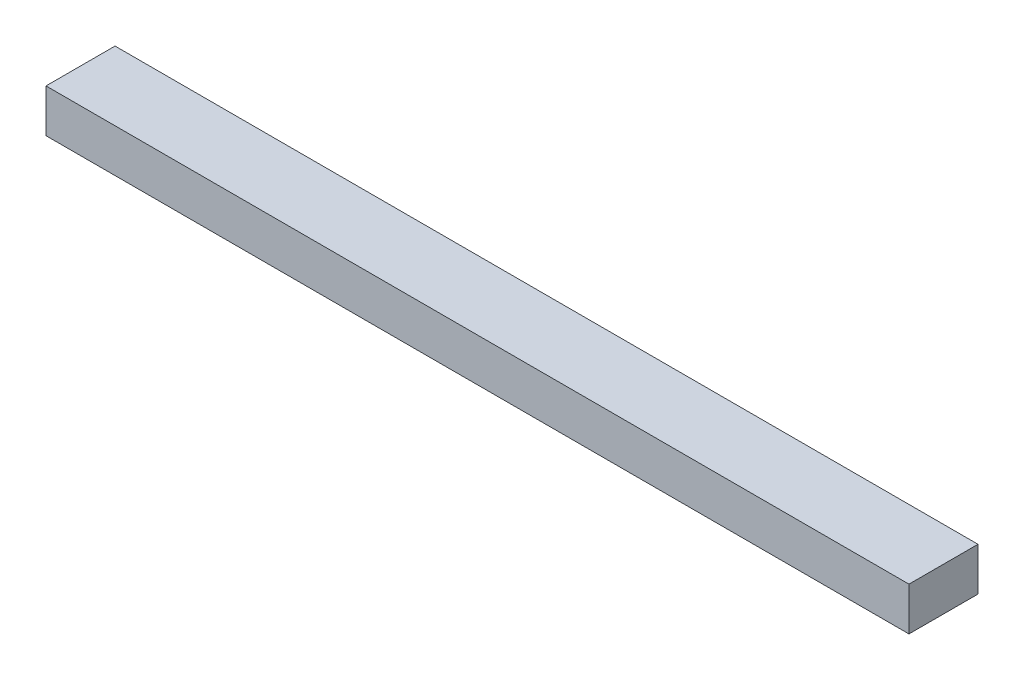
ISO-10303-21;
HEADER;
FILE_DESCRIPTION(('STEP AP214'),'2;1');
FILE_NAME('part.step','',(''),(''),'','','');
FILE_SCHEMA(('AUTOMOTIVE_DESIGN { 1 0 10303 214 1 1 1 1 }'));
ENDSEC;
DATA;
#1=APPLICATION_CONTEXT('core data for automotive mechanical design processes');
#2=APPLICATION_PROTOCOL_DEFINITION('international standard','automotive_design',2000,#1);
#3=PRODUCT_CONTEXT('',#1,'mechanical');
#4=PRODUCT('Part','Part','',(#3));
#5=PRODUCT_RELATED_PRODUCT_CATEGORY('part','',(#4));
#6=PRODUCT_DEFINITION_FORMATION('','',#4);
#7=PRODUCT_DEFINITION_CONTEXT('part definition',#1,'design');
#8=PRODUCT_DEFINITION('design','',#6,#7);
#9=PRODUCT_DEFINITION_SHAPE('','',#8);
#10=(LENGTH_UNIT() NAMED_UNIT(*) SI_UNIT(.MILLI.,.METRE.));
#11=(NAMED_UNIT(*) PLANE_ANGLE_UNIT() SI_UNIT($,.RADIAN.));
#12=(NAMED_UNIT(*) SI_UNIT($,.STERADIAN.) SOLID_ANGLE_UNIT());
#13=UNCERTAINTY_MEASURE_WITH_UNIT(LENGTH_MEASURE(1.E-05),#10,'distance_accuracy_value','');
#14=(GEOMETRIC_REPRESENTATION_CONTEXT(3) GLOBAL_UNCERTAINTY_ASSIGNED_CONTEXT((#13)) GLOBAL_UNIT_ASSIGNED_CONTEXT((#10,
#11,#12)) REPRESENTATION_CONTEXT('',''));
#15=CARTESIAN_POINT('',(0.,0.,0.));
#16=DIRECTION('',(0.,0.,1.));
#17=DIRECTION('',(1.,0.,0.));
#18=AXIS2_PLACEMENT_3D('',#15,#16,#17);
#19=CARTESIAN_POINT('',(500.,50.,-40.));
#20=DIRECTION('',(-1.,0.,0.));
#21=DIRECTION('',(0.,0.,1.));
#22=AXIS2_PLACEMENT_3D('',#19,#20,#21);
#23=PLANE('',#22);
#24=DIRECTION('',(0.,0.,-1.));
#25=VECTOR('',#24,1.);
#26=CARTESIAN_POINT('',(500.,0.,-40.));
#27=LINE('',#26,#25);
#28=CARTESIAN_POINT('',(500.,0.,40.));
#29=VERTEX_POINT('',#28);
#30=CARTESIAN_POINT('',(500.,0.,-40.));
#31=VERTEX_POINT('',#30);
#32=EDGE_CURVE('E98',#29,#31,#27,.T.);
#33=ORIENTED_EDGE('',*,*,#32,.T.);
#34=DIRECTION('',(0.,-1.,0.));
#35=VECTOR('',#34,1.);
#36=CARTESIAN_POINT('',(500.,50.,-40.));
#37=LINE('',#36,#35);
#38=CARTESIAN_POINT('',(500.,50.,-40.));
#39=VERTEX_POINT('',#38);
#40=EDGE_CURVE('E11',#39,#31,#37,.T.);
#41=ORIENTED_EDGE('',*,*,#40,.F.);
#42=DIRECTION('',(0.,0.,-1.));
#43=VECTOR('',#42,1.);
#44=CARTESIAN_POINT('',(500.,50.,-40.));
#45=LINE('',#44,#43);
#46=CARTESIAN_POINT('',(500.,50.,40.));
#47=VERTEX_POINT('',#46);
#48=EDGE_CURVE('E86',#47,#39,#45,.T.);
#49=ORIENTED_EDGE('',*,*,#48,.F.);
#50=DIRECTION('',(0.,-1.,0.));
#51=VECTOR('',#50,1.);
#52=CARTESIAN_POINT('',(500.,50.,40.));
#53=LINE('',#52,#51);
#54=EDGE_CURVE('E94',#47,#29,#53,.T.);
#55=ORIENTED_EDGE('',*,*,#54,.T.);
#56=EDGE_LOOP('',(#33,#41,#49,#55));
#57=FACE_BOUND('',#56,.T.);
#58=ADVANCED_FACE('F35',(#57),#23,.F.);
#59=CARTESIAN_POINT('',(-500.,50.,-40.));
#60=DIRECTION('',(0.,0.,1.));
#61=DIRECTION('',(1.,0.,0.));
#62=AXIS2_PLACEMENT_3D('',#59,#60,#61);
#63=PLANE('',#62);
#64=DIRECTION('',(-1.,0.,0.));
#65=VECTOR('',#64,1.);
#66=CARTESIAN_POINT('',(-500.,0.,-40.));
#67=LINE('',#66,#65);
#68=CARTESIAN_POINT('',(-500.,0.,-40.));
#69=VERTEX_POINT('',#68);
#70=EDGE_CURVE('E90',#31,#69,#67,.T.);
#71=ORIENTED_EDGE('',*,*,#70,.T.);
#72=DIRECTION('',(0.,-1.,0.));
#73=VECTOR('',#72,1.);
#74=CARTESIAN_POINT('',(-500.,50.,-40.));
#75=LINE('',#74,#73);
#76=CARTESIAN_POINT('',(-500.,50.,-40.));
#77=VERTEX_POINT('',#76);
#78=EDGE_CURVE('E43',#77,#69,#75,.T.);
#79=ORIENTED_EDGE('',*,*,#78,.F.);
#80=DIRECTION('',(-1.,0.,0.));
#81=VECTOR('',#80,1.);
#82=CARTESIAN_POINT('',(-500.,50.,-40.));
#83=LINE('',#82,#81);
#84=EDGE_CURVE('E81',#39,#77,#83,.T.);
#85=ORIENTED_EDGE('',*,*,#84,.F.);
#86=ORIENTED_EDGE('',*,*,#40,.T.);
#87=EDGE_LOOP('',(#71,#79,#85,#86));
#88=FACE_BOUND('',#87,.T.);
#89=ADVANCED_FACE('F89',(#88),#63,.F.);
#90=CARTESIAN_POINT('',(-500.,50.,-40.));
#91=DIRECTION('',(1.,0.,0.));
#92=DIRECTION('',(0.,0.,-1.));
#93=AXIS2_PLACEMENT_3D('',#90,#91,#92);
#94=PLANE('',#93);
#95=DIRECTION('',(0.,0.,1.));
#96=VECTOR('',#95,1.);
#97=CARTESIAN_POINT('',(-500.,0.,-40.));
#98=LINE('',#97,#96);
#99=CARTESIAN_POINT('',(-500.,0.,40.));
#100=VERTEX_POINT('',#99);
#101=EDGE_CURVE('E68',#69,#100,#98,.T.);
#102=ORIENTED_EDGE('',*,*,#101,.T.);
#103=DIRECTION('',(0.,-1.,0.));
#104=VECTOR('',#103,1.);
#105=CARTESIAN_POINT('',(-500.,50.,40.));
#106=LINE('',#105,#104);
#107=CARTESIAN_POINT('',(-500.,50.,40.));
#108=VERTEX_POINT('',#107);
#109=EDGE_CURVE('E91',#108,#100,#106,.T.);
#110=ORIENTED_EDGE('',*,*,#109,.F.);
#111=DIRECTION('',(0.,0.,1.));
#112=VECTOR('',#111,1.);
#113=CARTESIAN_POINT('',(-500.,50.,-40.));
#114=LINE('',#113,#112);
#115=EDGE_CURVE('E84',#77,#108,#114,.T.);
#116=ORIENTED_EDGE('',*,*,#115,.F.);
#117=ORIENTED_EDGE('',*,*,#78,.T.);
#118=EDGE_LOOP('',(#102,#110,#116,#117));
#119=FACE_BOUND('',#118,.T.);
#120=ADVANCED_FACE('F92',(#119),#94,.F.);
#121=CARTESIAN_POINT('',(-500.,50.,40.));
#122=DIRECTION('',(0.,0.,-1.));
#123=DIRECTION('',(-1.,0.,0.));
#124=AXIS2_PLACEMENT_3D('',#121,#122,#123);
#125=PLANE('',#124);
#126=DIRECTION('',(1.,0.,0.));
#127=VECTOR('',#126,1.);
#128=CARTESIAN_POINT('',(-500.,0.,40.));
#129=LINE('',#128,#127);
#130=EDGE_CURVE('E74',#100,#29,#129,.T.);
#131=ORIENTED_EDGE('',*,*,#130,.T.);
#132=ORIENTED_EDGE('',*,*,#54,.F.);
#133=DIRECTION('',(1.,0.,0.));
#134=VECTOR('',#133,1.);
#135=CARTESIAN_POINT('',(-500.,50.,40.));
#136=LINE('',#135,#134);
#137=EDGE_CURVE('E51',#108,#47,#136,.T.);
#138=ORIENTED_EDGE('',*,*,#137,.F.);
#139=ORIENTED_EDGE('',*,*,#109,.T.);
#140=EDGE_LOOP('',(#131,#132,#138,#139));
#141=FACE_BOUND('',#140,.T.);
#142=ADVANCED_FACE('F105',(#141),#125,.F.);
#143=CARTESIAN_POINT('',(0.,50.,0.));
#144=DIRECTION('',(0.,1.,0.));
#145=DIRECTION('',(0.,0.,1.));
#146=AXIS2_PLACEMENT_3D('',#143,#144,#145);
#147=PLANE('',#146);
#148=ORIENTED_EDGE('',*,*,#48,.T.);
#149=ORIENTED_EDGE('',*,*,#84,.T.);
#150=ORIENTED_EDGE('',*,*,#115,.T.);
#151=ORIENTED_EDGE('',*,*,#137,.T.);
#152=EDGE_LOOP('',(#148,#149,#150,#151));
#153=FACE_BOUND('',#152,.T.);
#154=ADVANCED_FACE('F82',(#153),#147,.T.);
#155=CARTESIAN_POINT('',(0.,0.,0.));
#156=DIRECTION('',(0.,1.,0.));
#157=DIRECTION('',(0.,0.,1.));
#158=AXIS2_PLACEMENT_3D('',#155,#156,#157);
#159=PLANE('',#158);
#160=ORIENTED_EDGE('',*,*,#32,.F.);
#161=ORIENTED_EDGE('',*,*,#130,.F.);
#162=ORIENTED_EDGE('',*,*,#101,.F.);
#163=ORIENTED_EDGE('',*,*,#70,.F.);
#164=EDGE_LOOP('',(#160,#161,#162,#163));
#165=FACE_BOUND('',#164,.T.);
#166=ADVANCED_FACE('F108',(#165),#159,.F.);
#167=CLOSED_SHELL('',(#58,#89,#120,#142,#154,#166));
#168=MANIFOLD_SOLID_BREP('B2',#167);
#169=ADVANCED_BREP_SHAPE_REPRESENTATION('',(#18,#168),#14);
#170=SHAPE_DEFINITION_REPRESENTATION(#9,#169);
ENDSEC;
END-ISO-10303-21;
